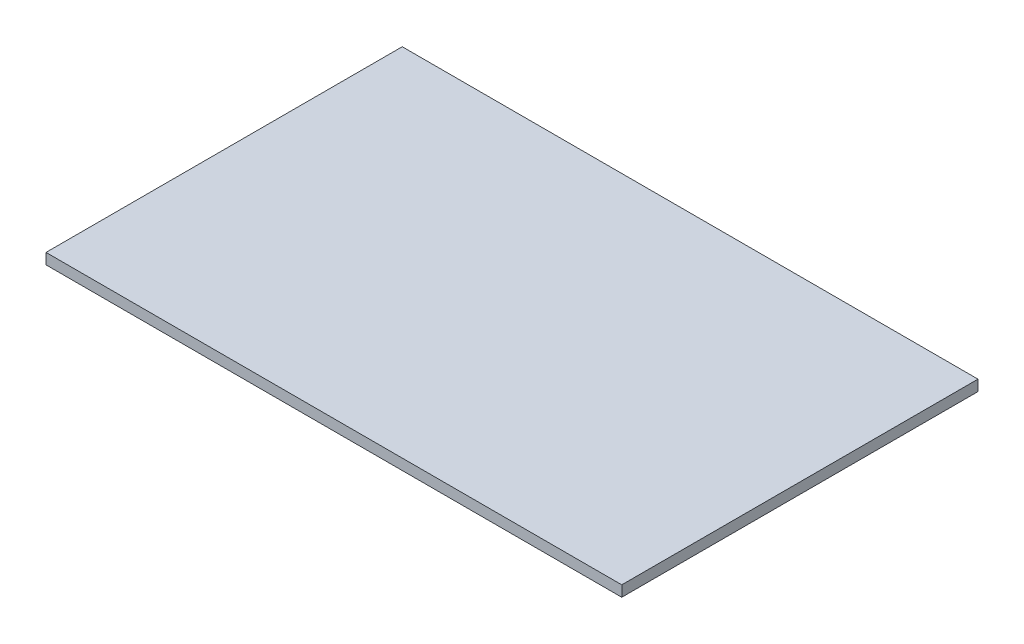
ISO-10303-21;
HEADER;
FILE_DESCRIPTION(('STEP AP214'),'2;1');
FILE_NAME('part.step','',(''),(''),'','','');
FILE_SCHEMA(('AUTOMOTIVE_DESIGN { 1 0 10303 214 1 1 1 1 }'));
ENDSEC;
DATA;
#1=APPLICATION_CONTEXT('core data for automotive mechanical design processes');
#2=APPLICATION_PROTOCOL_DEFINITION('international standard','automotive_design',2000,#1);
#3=PRODUCT_CONTEXT('',#1,'mechanical');
#4=PRODUCT('Part','Part','',(#3));
#5=PRODUCT_RELATED_PRODUCT_CATEGORY('part','',(#4));
#6=PRODUCT_DEFINITION_FORMATION('','',#4);
#7=PRODUCT_DEFINITION_CONTEXT('part definition',#1,'design');
#8=PRODUCT_DEFINITION('design','',#6,#7);
#9=PRODUCT_DEFINITION_SHAPE('','',#8);
#10=(LENGTH_UNIT() NAMED_UNIT(*) SI_UNIT(.MILLI.,.METRE.));
#11=(NAMED_UNIT(*) PLANE_ANGLE_UNIT() SI_UNIT($,.RADIAN.));
#12=(NAMED_UNIT(*) SI_UNIT($,.STERADIAN.) SOLID_ANGLE_UNIT());
#13=UNCERTAINTY_MEASURE_WITH_UNIT(LENGTH_MEASURE(1.E-05),#10,'distance_accuracy_value','');
#14=(GEOMETRIC_REPRESENTATION_CONTEXT(3) GLOBAL_UNCERTAINTY_ASSIGNED_CONTEXT((#13)) GLOBAL_UNIT_ASSIGNED_CONTEXT((#10,
#11,#12)) REPRESENTATION_CONTEXT('',''));
#15=CARTESIAN_POINT('',(0.,0.,0.));
#16=DIRECTION('',(0.,0.,1.));
#17=DIRECTION('',(1.,0.,0.));
#18=AXIS2_PLACEMENT_3D('',#15,#16,#17);
#19=CARTESIAN_POINT('',(0.,3.,0.));
#20=DIRECTION('',(1.,0.,0.));
#21=DIRECTION('',(0.,0.,-1.));
#22=AXIS2_PLACEMENT_3D('',#19,#20,#21);
#23=PLANE('',#22);
#24=DIRECTION('',(0.,0.,1.));
#25=VECTOR('',#24,1.);
#26=CARTESIAN_POINT('',(0.,0.,0.));
#27=LINE('',#26,#25);
#28=CARTESIAN_POINT('',(0.,0.,-99.));
#29=VERTEX_POINT('',#28);
#30=CARTESIAN_POINT('',(0.,0.,0.));
#31=VERTEX_POINT('',#30);
#32=EDGE_CURVE('E96',#29,#31,#27,.T.);
#33=ORIENTED_EDGE('',*,*,#32,.T.);
#34=DIRECTION('',(0.,-1.,0.));
#35=VECTOR('',#34,1.);
#36=CARTESIAN_POINT('',(0.,3.,0.));
#37=LINE('',#36,#35);
#38=CARTESIAN_POINT('',(0.,3.,0.));
#39=VERTEX_POINT('',#38);
#40=EDGE_CURVE('E11',#39,#31,#37,.T.);
#41=ORIENTED_EDGE('',*,*,#40,.F.);
#42=DIRECTION('',(0.,0.,1.));
#43=VECTOR('',#42,1.);
#44=CARTESIAN_POINT('',(0.,3.,0.));
#45=LINE('',#44,#43);
#46=CARTESIAN_POINT('',(0.,3.,-99.));
#47=VERTEX_POINT('',#46);
#48=EDGE_CURVE('E84',#47,#39,#45,.T.);
#49=ORIENTED_EDGE('',*,*,#48,.F.);
#50=DIRECTION('',(0.,-1.,0.));
#51=VECTOR('',#50,1.);
#52=CARTESIAN_POINT('',(0.,3.,-99.));
#53=LINE('',#52,#51);
#54=EDGE_CURVE('E92',#47,#29,#53,.T.);
#55=ORIENTED_EDGE('',*,*,#54,.T.);
#56=EDGE_LOOP('',(#33,#41,#49,#55));
#57=FACE_BOUND('',#56,.T.);
#58=ADVANCED_FACE('F33',(#57),#23,.F.);
#59=CARTESIAN_POINT('',(0.,3.,0.));
#60=DIRECTION('',(0.,0.,-1.));
#61=DIRECTION('',(-1.,0.,0.));
#62=AXIS2_PLACEMENT_3D('',#59,#60,#61);
#63=PLANE('',#62);
#64=DIRECTION('',(1.,0.,0.));
#65=VECTOR('',#64,1.);
#66=CARTESIAN_POINT('',(0.,0.,0.));
#67=LINE('',#66,#65);
#68=CARTESIAN_POINT('',(160.,0.,0.));
#69=VERTEX_POINT('',#68);
#70=EDGE_CURVE('E88',#31,#69,#67,.T.);
#71=ORIENTED_EDGE('',*,*,#70,.T.);
#72=DIRECTION('',(0.,-1.,0.));
#73=VECTOR('',#72,1.);
#74=CARTESIAN_POINT('',(160.,3.,0.));
#75=LINE('',#74,#73);
#76=CARTESIAN_POINT('',(160.,3.,0.));
#77=VERTEX_POINT('',#76);
#78=EDGE_CURVE('E41',#77,#69,#75,.T.);
#79=ORIENTED_EDGE('',*,*,#78,.F.);
#80=DIRECTION('',(1.,0.,0.));
#81=VECTOR('',#80,1.);
#82=CARTESIAN_POINT('',(0.,3.,0.));
#83=LINE('',#82,#81);
#84=EDGE_CURVE('E79',#39,#77,#83,.T.);
#85=ORIENTED_EDGE('',*,*,#84,.F.);
#86=ORIENTED_EDGE('',*,*,#40,.T.);
#87=EDGE_LOOP('',(#71,#79,#85,#86));
#88=FACE_BOUND('',#87,.T.);
#89=ADVANCED_FACE('F87',(#88),#63,.F.);
#90=CARTESIAN_POINT('',(160.,3.,0.));
#91=DIRECTION('',(-1.,0.,0.));
#92=DIRECTION('',(0.,0.,1.));
#93=AXIS2_PLACEMENT_3D('',#90,#91,#92);
#94=PLANE('',#93);
#95=DIRECTION('',(0.,0.,-1.));
#96=VECTOR('',#95,1.);
#97=CARTESIAN_POINT('',(160.,0.,0.));
#98=LINE('',#97,#96);
#99=CARTESIAN_POINT('',(160.,0.,-99.));
#100=VERTEX_POINT('',#99);
#101=EDGE_CURVE('E66',#69,#100,#98,.T.);
#102=ORIENTED_EDGE('',*,*,#101,.T.);
#103=DIRECTION('',(0.,-1.,0.));
#104=VECTOR('',#103,1.);
#105=CARTESIAN_POINT('',(160.,3.,-99.));
#106=LINE('',#105,#104);
#107=CARTESIAN_POINT('',(160.,3.,-99.));
#108=VERTEX_POINT('',#107);
#109=EDGE_CURVE('E89',#108,#100,#106,.T.);
#110=ORIENTED_EDGE('',*,*,#109,.F.);
#111=DIRECTION('',(0.,0.,-1.));
#112=VECTOR('',#111,1.);
#113=CARTESIAN_POINT('',(160.,3.,0.));
#114=LINE('',#113,#112);
#115=EDGE_CURVE('E82',#77,#108,#114,.T.);
#116=ORIENTED_EDGE('',*,*,#115,.F.);
#117=ORIENTED_EDGE('',*,*,#78,.T.);
#118=EDGE_LOOP('',(#102,#110,#116,#117));
#119=FACE_BOUND('',#118,.T.);
#120=ADVANCED_FACE('F90',(#119),#94,.F.);
#121=CARTESIAN_POINT('',(0.,3.,-99.));
#122=DIRECTION('',(0.,0.,1.));
#123=DIRECTION('',(1.,0.,0.));
#124=AXIS2_PLACEMENT_3D('',#121,#122,#123);
#125=PLANE('',#124);
#126=DIRECTION('',(-1.,0.,0.));
#127=VECTOR('',#126,1.);
#128=CARTESIAN_POINT('',(0.,0.,-99.));
#129=LINE('',#128,#127);
#130=EDGE_CURVE('E72',#100,#29,#129,.T.);
#131=ORIENTED_EDGE('',*,*,#130,.T.);
#132=ORIENTED_EDGE('',*,*,#54,.F.);
#133=DIRECTION('',(-1.,0.,0.));
#134=VECTOR('',#133,1.);
#135=CARTESIAN_POINT('',(0.,3.,-99.));
#136=LINE('',#135,#134);
#137=EDGE_CURVE('E49',#108,#47,#136,.T.);
#138=ORIENTED_EDGE('',*,*,#137,.F.);
#139=ORIENTED_EDGE('',*,*,#109,.T.);
#140=EDGE_LOOP('',(#131,#132,#138,#139));
#141=FACE_BOUND('',#140,.T.);
#142=ADVANCED_FACE('F103',(#141),#125,.F.);
#143=CARTESIAN_POINT('',(0.,3.,0.));
#144=DIRECTION('',(0.,-1.,0.));
#145=DIRECTION('',(0.,0.,-1.));
#146=AXIS2_PLACEMENT_3D('',#143,#144,#145);
#147=PLANE('',#146);
#148=ORIENTED_EDGE('',*,*,#48,.T.);
#149=ORIENTED_EDGE('',*,*,#84,.T.);
#150=ORIENTED_EDGE('',*,*,#115,.T.);
#151=ORIENTED_EDGE('',*,*,#137,.T.);
#152=EDGE_LOOP('',(#148,#149,#150,#151));
#153=FACE_BOUND('',#152,.T.);
#154=ADVANCED_FACE('F80',(#153),#147,.F.);
#155=CARTESIAN_POINT('',(0.,0.,0.));
#156=DIRECTION('',(0.,-1.,0.));
#157=DIRECTION('',(0.,0.,-1.));
#158=AXIS2_PLACEMENT_3D('',#155,#156,#157);
#159=PLANE('',#158);
#160=ORIENTED_EDGE('',*,*,#32,.F.);
#161=ORIENTED_EDGE('',*,*,#130,.F.);
#162=ORIENTED_EDGE('',*,*,#101,.F.);
#163=ORIENTED_EDGE('',*,*,#70,.F.);
#164=EDGE_LOOP('',(#160,#161,#162,#163));
#165=FACE_BOUND('',#164,.T.);
#166=ADVANCED_FACE('F106',(#165),#159,.T.);
#167=CLOSED_SHELL('',(#58,#89,#120,#142,#154,#166));
#168=MANIFOLD_SOLID_BREP('B2',#167);
#169=ADVANCED_BREP_SHAPE_REPRESENTATION('',(#18,#168),#14);
#170=SHAPE_DEFINITION_REPRESENTATION(#9,#169);
ENDSEC;
END-ISO-10303-21;
